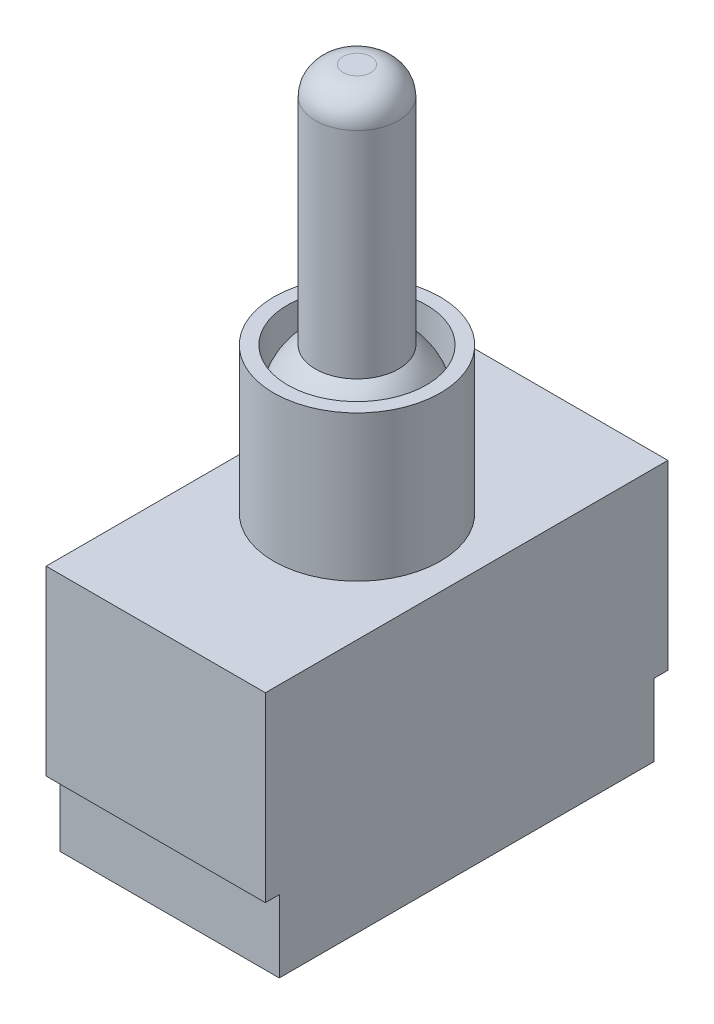
ISO-10303-21;
HEADER;
FILE_DESCRIPTION(('STEP AP214'),'2;1');
FILE_NAME('part.step','',(''),(''),'','','');
FILE_SCHEMA(('AUTOMOTIVE_DESIGN { 1 0 10303 214 1 1 1 1 }'));
ENDSEC;
DATA;
#1=APPLICATION_CONTEXT('core data for automotive mechanical design processes');
#2=APPLICATION_PROTOCOL_DEFINITION('international standard','automotive_design',2000,#1);
#3=PRODUCT_CONTEXT('',#1,'mechanical');
#4=PRODUCT('Part','Part','',(#3));
#5=PRODUCT_RELATED_PRODUCT_CATEGORY('part','',(#4));
#6=PRODUCT_DEFINITION_FORMATION('','',#4);
#7=PRODUCT_DEFINITION_CONTEXT('part definition',#1,'design');
#8=PRODUCT_DEFINITION('design','',#6,#7);
#9=PRODUCT_DEFINITION_SHAPE('','',#8);
#10=(LENGTH_UNIT() NAMED_UNIT(*) SI_UNIT(.MILLI.,.METRE.));
#11=(NAMED_UNIT(*) PLANE_ANGLE_UNIT() SI_UNIT($,.RADIAN.));
#12=(NAMED_UNIT(*) SI_UNIT($,.STERADIAN.) SOLID_ANGLE_UNIT());
#13=UNCERTAINTY_MEASURE_WITH_UNIT(LENGTH_MEASURE(1.E-05),#10,'distance_accuracy_value','');
#14=(GEOMETRIC_REPRESENTATION_CONTEXT(3) GLOBAL_UNCERTAINTY_ASSIGNED_CONTEXT((#13)) GLOBAL_UNIT_ASSIGNED_CONTEXT((#10,
#11,#12)) REPRESENTATION_CONTEXT('',''));
#15=CARTESIAN_POINT('',(0.,0.,0.));
#16=DIRECTION('',(0.,0.,1.));
#17=DIRECTION('',(1.,0.,0.));
#18=AXIS2_PLACEMENT_3D('',#15,#16,#17);
#19=CARTESIAN_POINT('',(0.,0.,0.));
#20=DIRECTION('',(0.,1.,0.));
#21=DIRECTION('',(0.,0.,1.));
#22=AXIS2_PLACEMENT_3D('',#19,#20,#21);
#23=PLANE('',#22);
#24=DIRECTION('',(-1.,0.,0.));
#25=VECTOR('',#24,1.);
#26=CARTESIAN_POINT('',(7.9,0.,13.5));
#27=LINE('',#26,#25);
#28=CARTESIAN_POINT('',(7.9,0.,13.5));
#29=VERTEX_POINT('',#28);
#30=CARTESIAN_POINT('',(-7.9,0.,13.5));
#31=VERTEX_POINT('',#30);
#32=EDGE_CURVE('E52',#29,#31,#27,.T.);
#33=ORIENTED_EDGE('',*,*,#32,.F.);
#34=DIRECTION('',(0.,0.,-1.));
#35=VECTOR('',#34,1.);
#36=CARTESIAN_POINT('',(7.9,0.,14.5));
#37=LINE('',#36,#35);
#38=CARTESIAN_POINT('',(7.9,0.,14.5));
#39=VERTEX_POINT('',#38);
#40=EDGE_CURVE('E159',#39,#29,#37,.T.);
#41=ORIENTED_EDGE('',*,*,#40,.F.);
#42=DIRECTION('',(1.,0.,0.));
#43=VECTOR('',#42,1.);
#44=CARTESIAN_POINT('',(7.9,0.,14.5));
#45=LINE('',#44,#43);
#46=CARTESIAN_POINT('',(-7.9,0.,14.5));
#47=VERTEX_POINT('',#46);
#48=EDGE_CURVE('E156',#47,#39,#45,.T.);
#49=ORIENTED_EDGE('',*,*,#48,.F.);
#50=DIRECTION('',(0.,0.,1.));
#51=VECTOR('',#50,1.);
#52=CARTESIAN_POINT('',(-7.9,0.,14.5));
#53=LINE('',#52,#51);
#54=EDGE_CURVE('E57',#31,#47,#53,.T.);
#55=ORIENTED_EDGE('',*,*,#54,.F.);
#56=EDGE_LOOP('',(#33,#41,#49,#55));
#57=FACE_BOUND('',#56,.T.);
#58=ADVANCED_FACE('F37',(#57),#23,.F.);
#59=DIRECTION('',(1.,0.,0.));
#60=VECTOR('',#59,1.);
#61=CARTESIAN_POINT('',(7.9,0.,-13.5));
#62=LINE('',#61,#60);
#63=CARTESIAN_POINT('',(-7.9,0.,-13.5));
#64=VERTEX_POINT('',#63);
#65=CARTESIAN_POINT('',(7.9,0.,-13.5));
#66=VERTEX_POINT('',#65);
#67=EDGE_CURVE('E329',#64,#66,#62,.T.);
#68=ORIENTED_EDGE('',*,*,#67,.F.);
#69=CARTESIAN_POINT('',(-7.9,0.,-14.5));
#70=VERTEX_POINT('',#69);
#71=EDGE_CURVE('E126',#70,#64,#53,.T.);
#72=ORIENTED_EDGE('',*,*,#71,.F.);
#73=DIRECTION('',(-1.,0.,0.));
#74=VECTOR('',#73,1.);
#75=CARTESIAN_POINT('',(7.9,0.,-14.5));
#76=LINE('',#75,#74);
#77=CARTESIAN_POINT('',(7.9,0.,-14.5));
#78=VERTEX_POINT('',#77);
#79=EDGE_CURVE('E148',#78,#70,#76,.T.);
#80=ORIENTED_EDGE('',*,*,#79,.F.);
#81=EDGE_CURVE('E158',#66,#78,#37,.T.);
#82=ORIENTED_EDGE('',*,*,#81,.F.);
#83=EDGE_LOOP('',(#68,#72,#80,#82));
#84=FACE_BOUND('',#83,.T.);
#85=ADVANCED_FACE('F192',(#84),#23,.F.);
#86=CARTESIAN_POINT('',(-7.9,13.1,14.5));
#87=DIRECTION('',(1.,0.,0.));
#88=DIRECTION('',(0.,0.,-1.));
#89=AXIS2_PLACEMENT_3D('',#86,#87,#88);
#90=PLANE('',#89);
#91=ORIENTED_EDGE('',*,*,#71,.T.);
#92=DIRECTION('',(0.,1.,0.));
#93=VECTOR('',#92,1.);
#94=CARTESIAN_POINT('',(-7.9,-5.2,-13.5));
#95=LINE('',#94,#93);
#96=CARTESIAN_POINT('',(-7.9,-5.2,-13.5));
#97=VERTEX_POINT('',#96);
#98=EDGE_CURVE('E106',#97,#64,#95,.T.);
#99=ORIENTED_EDGE('',*,*,#98,.F.);
#100=DIRECTION('',(0.,0.,-1.));
#101=VECTOR('',#100,1.);
#102=CARTESIAN_POINT('',(-7.9,-5.2,13.5));
#103=LINE('',#102,#101);
#104=CARTESIAN_POINT('',(-7.9,-5.2,13.5));
#105=VERTEX_POINT('',#104);
#106=EDGE_CURVE('E112',#105,#97,#103,.T.);
#107=ORIENTED_EDGE('',*,*,#106,.F.);
#108=DIRECTION('',(0.,1.,0.));
#109=VECTOR('',#108,1.);
#110=CARTESIAN_POINT('',(-7.9,-5.2,13.5));
#111=LINE('',#110,#109);
#112=EDGE_CURVE('E327',#105,#31,#111,.T.);
#113=ORIENTED_EDGE('',*,*,#112,.T.);
#114=ORIENTED_EDGE('',*,*,#54,.T.);
#115=DIRECTION('',(0.,-1.,0.));
#116=VECTOR('',#115,1.);
#117=CARTESIAN_POINT('',(-7.9,13.1,14.5));
#118=LINE('',#117,#116);
#119=CARTESIAN_POINT('',(-7.9,13.1,14.5));
#120=VERTEX_POINT('',#119);
#121=EDGE_CURVE('E169',#120,#47,#118,.T.);
#122=ORIENTED_EDGE('',*,*,#121,.F.);
#123=DIRECTION('',(0.,0.,1.));
#124=VECTOR('',#123,1.);
#125=CARTESIAN_POINT('',(-7.9,13.1,14.5));
#126=LINE('',#125,#124);
#127=CARTESIAN_POINT('',(-7.9,13.1,-14.5));
#128=VERTEX_POINT('',#127);
#129=EDGE_CURVE('E144',#128,#120,#126,.T.);
#130=ORIENTED_EDGE('',*,*,#129,.F.);
#131=DIRECTION('',(0.,-1.,0.));
#132=VECTOR('',#131,1.);
#133=CARTESIAN_POINT('',(-7.9,13.1,-14.5));
#134=LINE('',#133,#132);
#135=EDGE_CURVE('E154',#128,#70,#134,.T.);
#136=ORIENTED_EDGE('',*,*,#135,.T.);
#137=EDGE_LOOP('',(#91,#99,#107,#113,#114,#122,#130,#136));
#138=FACE_BOUND('',#137,.T.);
#139=ADVANCED_FACE('F123',(#138),#90,.F.);
#140=CARTESIAN_POINT('',(7.9,13.1,14.5));
#141=DIRECTION('',(0.,0.,-1.));
#142=DIRECTION('',(-1.,0.,0.));
#143=AXIS2_PLACEMENT_3D('',#140,#141,#142);
#144=PLANE('',#143);
#145=ORIENTED_EDGE('',*,*,#48,.T.);
#146=DIRECTION('',(0.,-1.,0.));
#147=VECTOR('',#146,1.);
#148=CARTESIAN_POINT('',(7.9,13.1,14.5));
#149=LINE('',#148,#147);
#150=CARTESIAN_POINT('',(7.9,13.1,14.5));
#151=VERTEX_POINT('',#150);
#152=EDGE_CURVE('E166',#151,#39,#149,.T.);
#153=ORIENTED_EDGE('',*,*,#152,.F.);
#154=DIRECTION('',(1.,0.,0.));
#155=VECTOR('',#154,1.);
#156=CARTESIAN_POINT('',(7.9,13.1,14.5));
#157=LINE('',#156,#155);
#158=EDGE_CURVE('E147',#120,#151,#157,.T.);
#159=ORIENTED_EDGE('',*,*,#158,.F.);
#160=ORIENTED_EDGE('',*,*,#121,.T.);
#161=EDGE_LOOP('',(#145,#153,#159,#160));
#162=FACE_BOUND('',#161,.T.);
#163=ADVANCED_FACE('F209',(#162),#144,.F.);
#164=CARTESIAN_POINT('',(7.9,13.1,14.5));
#165=DIRECTION('',(-1.,0.,0.));
#166=DIRECTION('',(0.,0.,1.));
#167=AXIS2_PLACEMENT_3D('',#164,#165,#166);
#168=PLANE('',#167);
#169=ORIENTED_EDGE('',*,*,#40,.T.);
#170=DIRECTION('',(0.,1.,0.));
#171=VECTOR('',#170,1.);
#172=CARTESIAN_POINT('',(7.9,-5.2,13.5));
#173=LINE('',#172,#171);
#174=CARTESIAN_POINT('',(7.9,-5.2,13.5));
#175=VERTEX_POINT('',#174);
#176=EDGE_CURVE('E132',#175,#29,#173,.T.);
#177=ORIENTED_EDGE('',*,*,#176,.F.);
#178=DIRECTION('',(0.,0.,1.));
#179=VECTOR('',#178,1.);
#180=CARTESIAN_POINT('',(7.9,-5.2,13.5));
#181=LINE('',#180,#179);
#182=CARTESIAN_POINT('',(7.9,-5.2,-13.5));
#183=VERTEX_POINT('',#182);
#184=EDGE_CURVE('E111',#183,#175,#181,.T.);
#185=ORIENTED_EDGE('',*,*,#184,.F.);
#186=DIRECTION('',(0.,1.,0.));
#187=VECTOR('',#186,1.);
#188=CARTESIAN_POINT('',(7.9,-5.2,-13.5));
#189=LINE('',#188,#187);
#190=EDGE_CURVE('E108',#183,#66,#189,.T.);
#191=ORIENTED_EDGE('',*,*,#190,.T.);
#192=ORIENTED_EDGE('',*,*,#81,.T.);
#193=DIRECTION('',(0.,-1.,0.));
#194=VECTOR('',#193,1.);
#195=CARTESIAN_POINT('',(7.9,13.1,-14.5));
#196=LINE('',#195,#194);
#197=CARTESIAN_POINT('',(7.9,13.1,-14.5));
#198=VERTEX_POINT('',#197);
#199=EDGE_CURVE('E163',#198,#78,#196,.T.);
#200=ORIENTED_EDGE('',*,*,#199,.F.);
#201=DIRECTION('',(0.,0.,-1.));
#202=VECTOR('',#201,1.);
#203=CARTESIAN_POINT('',(7.9,13.1,14.5));
#204=LINE('',#203,#202);
#205=EDGE_CURVE('E150',#151,#198,#204,.T.);
#206=ORIENTED_EDGE('',*,*,#205,.F.);
#207=ORIENTED_EDGE('',*,*,#152,.T.);
#208=EDGE_LOOP('',(#169,#177,#185,#191,#192,#200,#206,#207));
#209=FACE_BOUND('',#208,.T.);
#210=ADVANCED_FACE('F205',(#209),#168,.F.);
#211=CARTESIAN_POINT('',(7.9,13.1,-14.5));
#212=DIRECTION('',(0.,0.,1.));
#213=DIRECTION('',(1.,0.,0.));
#214=AXIS2_PLACEMENT_3D('',#211,#212,#213);
#215=PLANE('',#214);
#216=ORIENTED_EDGE('',*,*,#79,.T.);
#217=ORIENTED_EDGE('',*,*,#135,.F.);
#218=DIRECTION('',(-1.,0.,0.));
#219=VECTOR('',#218,1.);
#220=CARTESIAN_POINT('',(7.9,13.1,-14.5));
#221=LINE('',#220,#219);
#222=EDGE_CURVE('E152',#198,#128,#221,.T.);
#223=ORIENTED_EDGE('',*,*,#222,.F.);
#224=ORIENTED_EDGE('',*,*,#199,.T.);
#225=EDGE_LOOP('',(#216,#217,#223,#224));
#226=FACE_BOUND('',#225,.T.);
#227=ADVANCED_FACE('F202',(#226),#215,.F.);
#228=CARTESIAN_POINT('',(0.,13.1,0.));
#229=DIRECTION('',(0.,1.,0.));
#230=DIRECTION('',(0.,0.,1.));
#231=AXIS2_PLACEMENT_3D('',#228,#229,#230);
#232=PLANE('',#231);
#233=CARTESIAN_POINT('',(0.,13.1,0.));
#234=DIRECTION('',(0.,1.,0.));
#235=DIRECTION('',(0.,0.,1.));
#236=AXIS2_PLACEMENT_3D('',#233,#234,#235);
#237=CIRCLE('',#236,6.);
#238=CARTESIAN_POINT('',(0.,13.1,6.));
#239=VERTEX_POINT('',#238);
#240=EDGE_CURVE('E137',#239,#239,#237,.T.);
#241=ORIENTED_EDGE('',*,*,#240,.F.);
#242=EDGE_LOOP('',(#241));
#243=FACE_BOUND('',#242,.T.);
#244=ORIENTED_EDGE('',*,*,#129,.T.);
#245=ORIENTED_EDGE('',*,*,#158,.T.);
#246=ORIENTED_EDGE('',*,*,#205,.T.);
#247=ORIENTED_EDGE('',*,*,#222,.T.);
#248=EDGE_LOOP('',(#244,#245,#246,#247));
#249=FACE_BOUND('',#248,.T.);
#250=ADVANCED_FACE('F200',(#243,#249),#232,.T.);
#251=CARTESIAN_POINT('',(0.,23.6,0.));
#252=DIRECTION('',(0.,-1.,0.));
#253=DIRECTION('',(0.,0.,-1.));
#254=AXIS2_PLACEMENT_3D('',#251,#252,#253);
#255=CYLINDRICAL_SURFACE('',#254,6.);
#256=CARTESIAN_POINT('',(0.,23.6,0.));
#257=DIRECTION('',(0.,1.,0.));
#258=DIRECTION('',(0.,0.,1.));
#259=AXIS2_PLACEMENT_3D('',#256,#257,#258);
#260=CIRCLE('',#259,6.);
#261=CARTESIAN_POINT('',(0.,23.6,6.));
#262=VERTEX_POINT('',#261);
#263=EDGE_CURVE('E139',#262,#262,#260,.T.);
#264=ORIENTED_EDGE('',*,*,#263,.F.);
#265=EDGE_LOOP('',(#264));
#266=FACE_BOUND('',#265,.T.);
#267=ORIENTED_EDGE('',*,*,#240,.T.);
#268=EDGE_LOOP('',(#267));
#269=FACE_BOUND('',#268,.T.);
#270=ADVANCED_FACE('F237',(#266,#269),#255,.T.);
#271=CARTESIAN_POINT('',(0.,23.6,0.));
#272=DIRECTION('',(0.,1.,0.));
#273=DIRECTION('',(0.,0.,1.));
#274=AXIS2_PLACEMENT_3D('',#271,#272,#273);
#275=PLANE('',#274);
#276=CARTESIAN_POINT('',(0.,23.6,0.));
#277=DIRECTION('',(0.,1.,0.));
#278=DIRECTION('',(0.,0.,1.));
#279=AXIS2_PLACEMENT_3D('',#276,#277,#278);
#280=CIRCLE('',#279,5.);
#281=CARTESIAN_POINT('',(0.,23.6,5.));
#282=VERTEX_POINT('',#281);
#283=EDGE_CURVE('E127',#282,#282,#280,.T.);
#284=ORIENTED_EDGE('',*,*,#283,.F.);
#285=EDGE_LOOP('',(#284));
#286=FACE_BOUND('',#285,.T.);
#287=ORIENTED_EDGE('',*,*,#263,.T.);
#288=EDGE_LOOP('',(#287));
#289=FACE_BOUND('',#288,.T.);
#290=ADVANCED_FACE('F244',(#286,#289),#275,.T.);
#291=CARTESIAN_POINT('',(0.,19.6,0.));
#292=DIRECTION('',(0.,1.,0.));
#293=DIRECTION('',(0.,0.,1.));
#294=AXIS2_PLACEMENT_3D('',#291,#292,#293);
#295=CYLINDRICAL_SURFACE('',#294,5.);
#296=CARTESIAN_POINT('',(0.,19.6,0.));
#297=DIRECTION('',(0.,1.,0.));
#298=DIRECTION('',(0.,0.,1.));
#299=AXIS2_PLACEMENT_3D('',#296,#297,#298);
#300=CIRCLE('',#299,5.);
#301=CARTESIAN_POINT('',(0.,19.6,5.));
#302=VERTEX_POINT('',#301);
#303=EDGE_CURVE('E130',#302,#302,#300,.T.);
#304=ORIENTED_EDGE('',*,*,#303,.F.);
#305=EDGE_LOOP('',(#304));
#306=FACE_BOUND('',#305,.T.);
#307=ORIENTED_EDGE('',*,*,#283,.T.);
#308=EDGE_LOOP('',(#307));
#309=FACE_BOUND('',#308,.T.);
#310=ADVANCED_FACE('F251',(#306,#309),#295,.F.);
#311=CARTESIAN_POINT('',(0.,19.6,0.));
#312=DIRECTION('',(0.,0.,1.));
#313=DIRECTION('',(1.,0.,0.));
#314=AXIS2_PLACEMENT_3D('',#311,#312,#313);
#315=SPHERICAL_SURFACE('',#314,5.);
#316=CARTESIAN_POINT('',(0.,19.6,0.));
#317=DIRECTION('',(0.,1.,0.));
#318=DIRECTION('',(0.,0.,1.));
#319=AXIS2_PLACEMENT_3D('',#316,#317,#318);
#320=SPHERICAL_SURFACE('',#319,5.);
#321=ORIENTED_EDGE('',*,*,#303,.T.);
#322=EDGE_LOOP('',(#321));
#323=FACE_BOUND('',#322,.T.);
#324=CARTESIAN_POINT('',(0.,23.6,0.));
#325=DIRECTION('',(0.,-1.,0.));
#326=DIRECTION('',(0.,0.,-1.));
#327=AXIS2_PLACEMENT_3D('',#324,#325,#326);
#328=CIRCLE('',#327,3.);
#329=CARTESIAN_POINT('',(0.,23.6,-3.));
#330=VERTEX_POINT('',#329);
#331=EDGE_CURVE('E172',#330,#330,#328,.T.);
#332=ORIENTED_EDGE('',*,*,#331,.T.);
#333=EDGE_LOOP('',(#332));
#334=FACE_BOUND('',#333,.T.);
#335=ADVANCED_FACE('F259',(#323,#334),#320,.T.);
#336=CARTESIAN_POINT('',(0.,41.1,0.));
#337=DIRECTION('',(0.,1.,0.));
#338=DIRECTION('',(0.,0.,1.));
#339=AXIS2_PLACEMENT_3D('',#336,#337,#338);
#340=PLANE('',#339);
#341=CARTESIAN_POINT('',(0.,41.1,0.));
#342=DIRECTION('',(0.,1.,0.));
#343=DIRECTION('',(0.,0.,1.));
#344=AXIS2_PLACEMENT_3D('',#341,#342,#343);
#345=CIRCLE('',#344,1.);
#346=CARTESIAN_POINT('',(0.,41.1,1.));
#347=VERTEX_POINT('',#346);
#348=EDGE_CURVE('E45',#347,#347,#345,.T.);
#349=ORIENTED_EDGE('',*,*,#348,.T.);
#350=EDGE_LOOP('',(#349));
#351=FACE_BOUND('',#350,.T.);
#352=ADVANCED_FACE('F177',(#351),#340,.T.);
#353=CARTESIAN_POINT('',(0.,41.1,0.));
#354=DIRECTION('',(0.,-1.,0.));
#355=DIRECTION('',(0.,0.,-1.));
#356=AXIS2_PLACEMENT_3D('',#353,#354,#355);
#357=CYLINDRICAL_SURFACE('',#356,3.);
#358=CARTESIAN_POINT('',(0.,39.1,0.));
#359=DIRECTION('',(0.,1.,0.));
#360=DIRECTION('',(0.,0.,1.));
#361=AXIS2_PLACEMENT_3D('',#358,#359,#360);
#362=CIRCLE('',#361,3.);
#363=CARTESIAN_POINT('',(0.,39.1,3.));
#364=VERTEX_POINT('',#363);
#365=EDGE_CURVE('E11',#364,#364,#362,.F.);
#366=ORIENTED_EDGE('',*,*,#365,.T.);
#367=EDGE_LOOP('',(#366));
#368=FACE_BOUND('',#367,.T.);
#369=ORIENTED_EDGE('',*,*,#331,.F.);
#370=EDGE_LOOP('',(#369));
#371=FACE_BOUND('',#370,.T.);
#372=ADVANCED_FACE('F180',(#368,#371),#357,.T.);
#373=CARTESIAN_POINT('',(0.,39.1,0.));
#374=DIRECTION('',(0.,1.,0.));
#375=DIRECTION('',(0.,0.,1.));
#376=AXIS2_PLACEMENT_3D('',#373,#374,#375);
#377=DEGENERATE_TOROIDAL_SURFACE('',#376,1.,2.,.T.);
#378=ORIENTED_EDGE('',*,*,#365,.F.);
#379=EDGE_LOOP('',(#378));
#380=FACE_BOUND('',#379,.T.);
#381=ORIENTED_EDGE('',*,*,#348,.F.);
#382=EDGE_LOOP('',(#381));
#383=FACE_BOUND('',#382,.T.);
#384=ADVANCED_FACE('F39',(#380,#383),#377,.T.);
#385=CARTESIAN_POINT('',(7.9,-5.2,-13.5));
#386=DIRECTION('',(0.,0.,1.));
#387=DIRECTION('',(1.,0.,0.));
#388=AXIS2_PLACEMENT_3D('',#385,#386,#387);
#389=PLANE('',#388);
#390=ORIENTED_EDGE('',*,*,#67,.T.);
#391=ORIENTED_EDGE('',*,*,#190,.F.);
#392=DIRECTION('',(1.,0.,0.));
#393=VECTOR('',#392,1.);
#394=CARTESIAN_POINT('',(7.9,-5.2,-13.5));
#395=LINE('',#394,#393);
#396=EDGE_CURVE('E101',#97,#183,#395,.T.);
#397=ORIENTED_EDGE('',*,*,#396,.F.);
#398=ORIENTED_EDGE('',*,*,#98,.T.);
#399=EDGE_LOOP('',(#390,#391,#397,#398));
#400=FACE_BOUND('',#399,.T.);
#401=ADVANCED_FACE('F104',(#400),#389,.F.);
#402=CARTESIAN_POINT('',(7.9,-5.2,13.5));
#403=DIRECTION('',(0.,0.,-1.));
#404=DIRECTION('',(-1.,0.,0.));
#405=AXIS2_PLACEMENT_3D('',#402,#403,#404);
#406=PLANE('',#405);
#407=ORIENTED_EDGE('',*,*,#32,.T.);
#408=ORIENTED_EDGE('',*,*,#112,.F.);
#409=DIRECTION('',(-1.,0.,0.));
#410=VECTOR('',#409,1.);
#411=CARTESIAN_POINT('',(7.9,-5.2,13.5));
#412=LINE('',#411,#410);
#413=EDGE_CURVE('E117',#175,#105,#412,.T.);
#414=ORIENTED_EDGE('',*,*,#413,.F.);
#415=ORIENTED_EDGE('',*,*,#176,.T.);
#416=EDGE_LOOP('',(#407,#408,#414,#415));
#417=FACE_BOUND('',#416,.T.);
#418=ADVANCED_FACE('F186',(#417),#406,.F.);
#419=CARTESIAN_POINT('',(0.,-5.2,0.));
#420=DIRECTION('',(0.,1.,0.));
#421=DIRECTION('',(0.,0.,1.));
#422=AXIS2_PLACEMENT_3D('',#419,#420,#421);
#423=PLANE('',#422);
#424=ORIENTED_EDGE('',*,*,#106,.T.);
#425=ORIENTED_EDGE('',*,*,#396,.T.);
#426=ORIENTED_EDGE('',*,*,#184,.T.);
#427=ORIENTED_EDGE('',*,*,#413,.T.);
#428=EDGE_LOOP('',(#424,#425,#426,#427));
#429=FACE_BOUND('',#428,.T.);
#430=ADVANCED_FACE('F115',(#429),#423,.F.);
#431=CLOSED_SHELL('',(#58,#85,#139,#163,#210,#227,#250,#270,#290,#310,#335,#352,#372,#384,#401,
#418,#430));
#432=MANIFOLD_SOLID_BREP('B2',#431);
#433=ADVANCED_BREP_SHAPE_REPRESENTATION('',(#18,#432),#14);
#434=SHAPE_DEFINITION_REPRESENTATION(#9,#433);
ENDSEC;
END-ISO-10303-21;
